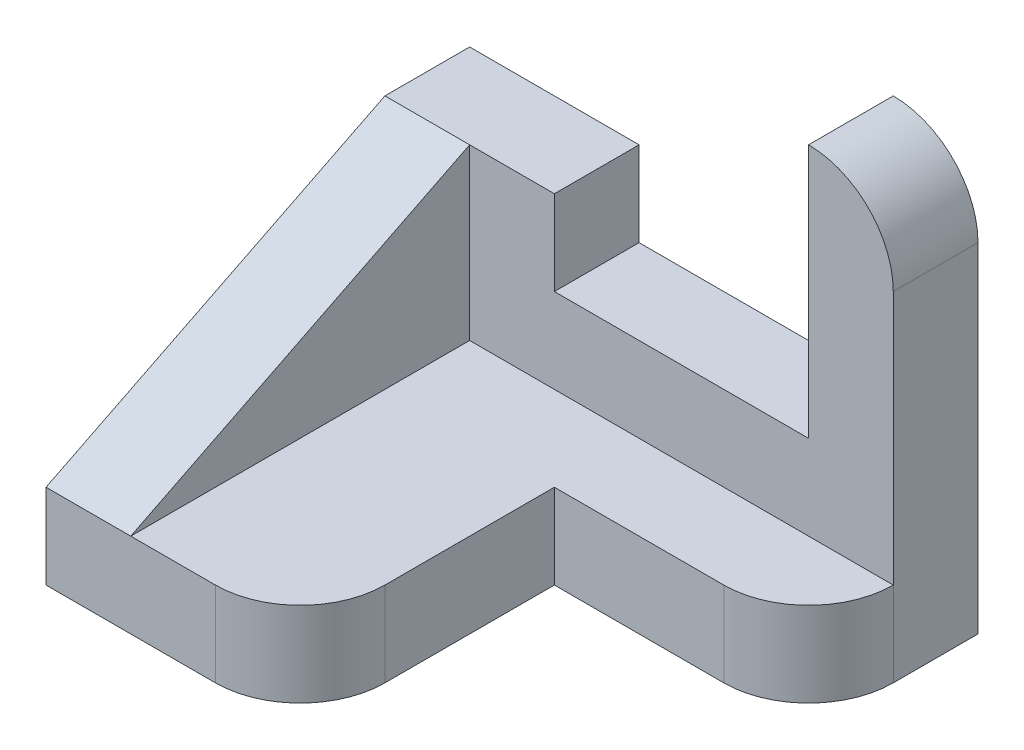
ISO-10303-21;
HEADER;
FILE_DESCRIPTION(('STEP AP214'),'2;1');
FILE_NAME('part.step','',(''),(''),'','','');
FILE_SCHEMA(('AUTOMOTIVE_DESIGN { 1 0 10303 214 1 1 1 1 }'));
ENDSEC;
DATA;
#1=APPLICATION_CONTEXT('core data for automotive mechanical design processes');
#2=APPLICATION_PROTOCOL_DEFINITION('international standard','automotive_design',2000,#1);
#3=PRODUCT_CONTEXT('',#1,'mechanical');
#4=PRODUCT('Part','Part','',(#3));
#5=PRODUCT_RELATED_PRODUCT_CATEGORY('part','',(#4));
#6=PRODUCT_DEFINITION_FORMATION('','',#4);
#7=PRODUCT_DEFINITION_CONTEXT('part definition',#1,'design');
#8=PRODUCT_DEFINITION('design','',#6,#7);
#9=PRODUCT_DEFINITION_SHAPE('','',#8);
#10=(LENGTH_UNIT() NAMED_UNIT(*) SI_UNIT(.MILLI.,.METRE.));
#11=(NAMED_UNIT(*) PLANE_ANGLE_UNIT() SI_UNIT($,.RADIAN.));
#12=(NAMED_UNIT(*) SI_UNIT($,.STERADIAN.) SOLID_ANGLE_UNIT());
#13=UNCERTAINTY_MEASURE_WITH_UNIT(LENGTH_MEASURE(1.E-05),#10,'distance_accuracy_value','');
#14=(GEOMETRIC_REPRESENTATION_CONTEXT(3) GLOBAL_UNCERTAINTY_ASSIGNED_CONTEXT((#13)) GLOBAL_UNIT_ASSIGNED_CONTEXT((#10,
#11,#12)) REPRESENTATION_CONTEXT('',''));
#15=CARTESIAN_POINT('',(0.,0.,0.));
#16=DIRECTION('',(0.,0.,1.));
#17=DIRECTION('',(1.,0.,0.));
#18=AXIS2_PLACEMENT_3D('',#15,#16,#17);
#19=CARTESIAN_POINT('',(0.,10.,0.));
#20=DIRECTION('',(0.,-1.,0.));
#21=DIRECTION('',(0.,0.,-1.));
#22=AXIS2_PLACEMENT_3D('',#19,#20,#21);
#23=PLANE('',#22);
#24=DIRECTION('',(1.,0.,0.));
#25=VECTOR('',#24,1.);
#26=CARTESIAN_POINT('',(30.,10.,-30.));
#27=LINE('',#26,#25);
#28=CARTESIAN_POINT('',(0.,10.,-30.));
#29=VERTEX_POINT('',#28);
#30=CARTESIAN_POINT('',(20.,10.,-30.));
#31=VERTEX_POINT('',#30);
#32=EDGE_CURVE('E231',#29,#31,#27,.T.);
#33=ORIENTED_EDGE('',*,*,#32,.T.);
#34=CARTESIAN_POINT('',(20.,10.,-40.));
#35=DIRECTION('',(0.,-1.,0.));
#36=DIRECTION('',(0.,0.,-1.));
#37=AXIS2_PLACEMENT_3D('',#34,#35,#36);
#38=CIRCLE('',#37,10.);
#39=CARTESIAN_POINT('',(30.,10.,-40.));
#40=VERTEX_POINT('',#39);
#41=EDGE_CURVE('E168',#31,#40,#38,.F.);
#42=ORIENTED_EDGE('',*,*,#41,.T.);
#43=DIRECTION('',(-1.,0.,0.));
#44=VECTOR('',#43,1.);
#45=CARTESIAN_POINT('',(-30.,10.,-40.));
#46=LINE('',#45,#44);
#47=CARTESIAN_POINT('',(-20.,10.,-40.));
#48=VERTEX_POINT('',#47);
#49=EDGE_CURVE('E158',#40,#48,#46,.T.);
#50=ORIENTED_EDGE('',*,*,#49,.T.);
#51=DIRECTION('',(0.,0.,1.));
#52=VECTOR('',#51,1.);
#53=CARTESIAN_POINT('',(-20.,10.,0.));
#54=LINE('',#53,#52);
#55=CARTESIAN_POINT('',(-20.,10.,0.));
#56=VERTEX_POINT('',#55);
#57=EDGE_CURVE('E144',#48,#56,#54,.T.);
#58=ORIENTED_EDGE('',*,*,#57,.T.);
#59=DIRECTION('',(1.,0.,0.));
#60=VECTOR('',#59,1.);
#61=CARTESIAN_POINT('',(0.,10.,0.));
#62=LINE('',#61,#60);
#63=CARTESIAN_POINT('',(-10.,10.,0.));
#64=VERTEX_POINT('',#63);
#65=EDGE_CURVE('E235',#56,#64,#62,.T.);
#66=ORIENTED_EDGE('',*,*,#65,.T.);
#67=CARTESIAN_POINT('',(-10.,10.,-10.));
#68=DIRECTION('',(0.,-1.,0.));
#69=DIRECTION('',(0.,0.,-1.));
#70=AXIS2_PLACEMENT_3D('',#67,#68,#69);
#71=CIRCLE('',#70,10.);
#72=CARTESIAN_POINT('',(0.,10.,-10.));
#73=VERTEX_POINT('',#72);
#74=EDGE_CURVE('E55',#64,#73,#71,.F.);
#75=ORIENTED_EDGE('',*,*,#74,.T.);
#76=DIRECTION('',(0.,0.,-1.));
#77=VECTOR('',#76,1.);
#78=CARTESIAN_POINT('',(0.,10.,-30.));
#79=LINE('',#78,#77);
#80=EDGE_CURVE('E228',#73,#29,#79,.T.);
#81=ORIENTED_EDGE('',*,*,#80,.T.);
#82=EDGE_LOOP('',(#33,#42,#50,#58,#66,#75,#81));
#83=FACE_BOUND('',#82,.T.);
#84=ADVANCED_FACE('F39',(#83),#23,.F.);
#85=CARTESIAN_POINT('',(0.,0.,-40.));
#86=DIRECTION('',(0.,0.,-1.));
#87=DIRECTION('',(0.,1.,0.));
#88=AXIS2_PLACEMENT_3D('',#85,#86,#87);
#89=PLANE('',#88);
#90=DIRECTION('',(0.,-1.,0.));
#91=VECTOR('',#90,1.);
#92=CARTESIAN_POINT('',(30.,50.,-40.));
#93=LINE('',#92,#91);
#94=CARTESIAN_POINT('',(30.,40.,-40.));
#95=VERTEX_POINT('',#94);
#96=EDGE_CURVE('E196',#95,#40,#93,.T.);
#97=ORIENTED_EDGE('',*,*,#96,.F.);
#98=CARTESIAN_POINT('',(20.,40.,-40.));
#99=DIRECTION('',(0.,0.,-1.));
#100=DIRECTION('',(0.,1.,0.));
#101=AXIS2_PLACEMENT_3D('',#98,#99,#100);
#102=CIRCLE('',#101,10.);
#103=CARTESIAN_POINT('',(20.,50.,-40.));
#104=VERTEX_POINT('',#103);
#105=EDGE_CURVE('E282',#95,#104,#102,.F.);
#106=ORIENTED_EDGE('',*,*,#105,.T.);
#107=DIRECTION('',(0.,1.,0.));
#108=VECTOR('',#107,1.);
#109=CARTESIAN_POINT('',(20.,20.,-40.));
#110=LINE('',#109,#108);
#111=CARTESIAN_POINT('',(20.,20.,-40.));
#112=VERTEX_POINT('',#111);
#113=EDGE_CURVE('E192',#112,#104,#110,.T.);
#114=ORIENTED_EDGE('',*,*,#113,.F.);
#115=DIRECTION('',(1.,0.,0.));
#116=VECTOR('',#115,1.);
#117=CARTESIAN_POINT('',(-9.99999999999999,20.,-40.));
#118=LINE('',#117,#116);
#119=CARTESIAN_POINT('',(-9.99999999999999,20.,-40.));
#120=VERTEX_POINT('',#119);
#121=EDGE_CURVE('E188',#120,#112,#118,.T.);
#122=ORIENTED_EDGE('',*,*,#121,.F.);
#123=DIRECTION('',(0.,-1.,0.));
#124=VECTOR('',#123,1.);
#125=CARTESIAN_POINT('',(-9.99999999999999,30.,-40.));
#126=LINE('',#125,#124);
#127=CARTESIAN_POINT('',(-9.99999999999999,30.,-40.));
#128=VERTEX_POINT('',#127);
#129=EDGE_CURVE('E184',#128,#120,#126,.T.);
#130=ORIENTED_EDGE('',*,*,#129,.F.);
#131=DIRECTION('',(1.,0.,0.));
#132=VECTOR('',#131,1.);
#133=CARTESIAN_POINT('',(-30.,30.,-40.));
#134=LINE('',#133,#132);
#135=CARTESIAN_POINT('',(-20.,30.,-40.));
#136=VERTEX_POINT('',#135);
#137=EDGE_CURVE('E161',#136,#128,#134,.T.);
#138=ORIENTED_EDGE('',*,*,#137,.F.);
#139=DIRECTION('',(0.,-1.,0.));
#140=VECTOR('',#139,1.);
#141=CARTESIAN_POINT('',(-20.,10.,-40.));
#142=LINE('',#141,#140);
#143=EDGE_CURVE('E147',#136,#48,#142,.T.);
#144=ORIENTED_EDGE('',*,*,#143,.T.);
#145=ORIENTED_EDGE('',*,*,#49,.F.);
#146=EDGE_LOOP('',(#97,#106,#114,#122,#130,#138,#144,#145));
#147=FACE_BOUND('',#146,.T.);
#148=ADVANCED_FACE('F157',(#147),#89,.F.);
#149=CARTESIAN_POINT('',(0.,10.,-30.));
#150=DIRECTION('',(-1.,0.,0.));
#151=DIRECTION('',(0.,0.,1.));
#152=AXIS2_PLACEMENT_3D('',#149,#150,#151);
#153=PLANE('',#152);
#154=ORIENTED_EDGE('',*,*,#80,.F.);
#155=DIRECTION('',(0.,-1.,0.));
#156=VECTOR('',#155,1.);
#157=CARTESIAN_POINT('',(0.,10.,-10.));
#158=LINE('',#157,#156);
#159=CARTESIAN_POINT('',(0.,0.,-10.));
#160=VERTEX_POINT('',#159);
#161=EDGE_CURVE('E48',#73,#160,#158,.T.);
#162=ORIENTED_EDGE('',*,*,#161,.T.);
#163=DIRECTION('',(0.,0.,-1.));
#164=VECTOR('',#163,1.);
#165=CARTESIAN_POINT('',(0.,0.,-30.));
#166=LINE('',#165,#164);
#167=CARTESIAN_POINT('',(0.,0.,-30.));
#168=VERTEX_POINT('',#167);
#169=EDGE_CURVE('E215',#160,#168,#166,.T.);
#170=ORIENTED_EDGE('',*,*,#169,.T.);
#171=DIRECTION('',(0.,-1.,0.));
#172=VECTOR('',#171,1.);
#173=CARTESIAN_POINT('',(0.,10.,-30.));
#174=LINE('',#173,#172);
#175=EDGE_CURVE('E268',#29,#168,#174,.T.);
#176=ORIENTED_EDGE('',*,*,#175,.F.);
#177=EDGE_LOOP('',(#154,#162,#170,#176));
#178=FACE_BOUND('',#177,.T.);
#179=ADVANCED_FACE('F302',(#178),#153,.F.);
#180=CARTESIAN_POINT('',(30.,10.,-30.));
#181=DIRECTION('',(0.,0.,-1.));
#182=DIRECTION('',(-1.,0.,0.));
#183=AXIS2_PLACEMENT_3D('',#180,#181,#182);
#184=PLANE('',#183);
#185=DIRECTION('',(1.,0.,0.));
#186=VECTOR('',#185,1.);
#187=CARTESIAN_POINT('',(30.,0.,-30.));
#188=LINE('',#187,#186);
#189=CARTESIAN_POINT('',(20.,0.,-30.));
#190=VERTEX_POINT('',#189);
#191=EDGE_CURVE('E242',#168,#190,#188,.T.);
#192=ORIENTED_EDGE('',*,*,#191,.T.);
#193=DIRECTION('',(0.,-1.,0.));
#194=VECTOR('',#193,1.);
#195=CARTESIAN_POINT('',(20.,10.,-30.));
#196=LINE('',#195,#194);
#197=EDGE_CURVE('E291',#190,#31,#196,.F.);
#198=ORIENTED_EDGE('',*,*,#197,.T.);
#199=ORIENTED_EDGE('',*,*,#32,.F.);
#200=ORIENTED_EDGE('',*,*,#175,.T.);
#201=EDGE_LOOP('',(#192,#198,#199,#200));
#202=FACE_BOUND('',#201,.T.);
#203=ADVANCED_FACE('F313',(#202),#184,.F.);
#204=CARTESIAN_POINT('',(30.,10.,-50.));
#205=DIRECTION('',(-1.,0.,0.));
#206=DIRECTION('',(0.,0.,1.));
#207=AXIS2_PLACEMENT_3D('',#204,#205,#206);
#208=PLANE('',#207);
#209=DIRECTION('',(0.,-1.,0.));
#210=VECTOR('',#209,1.);
#211=CARTESIAN_POINT('',(30.,10.,-50.));
#212=LINE('',#211,#210);
#213=CARTESIAN_POINT('',(30.,40.,-50.));
#214=VERTEX_POINT('',#213);
#215=CARTESIAN_POINT('',(30.,0.,-50.));
#216=VERTEX_POINT('',#215);
#217=EDGE_CURVE('E264',#214,#216,#212,.T.);
#218=ORIENTED_EDGE('',*,*,#217,.F.);
#219=DIRECTION('',(0.,0.,-1.));
#220=VECTOR('',#219,1.);
#221=CARTESIAN_POINT('',(30.,40.,-40.));
#222=LINE('',#221,#220);
#223=EDGE_CURVE('E279',#214,#95,#222,.F.);
#224=ORIENTED_EDGE('',*,*,#223,.T.);
#225=ORIENTED_EDGE('',*,*,#96,.T.);
#226=DIRECTION('',(0.,-1.,0.));
#227=VECTOR('',#226,1.);
#228=CARTESIAN_POINT('',(30.,10.,-40.));
#229=LINE('',#228,#227);
#230=CARTESIAN_POINT('',(30.,0.,-40.));
#231=VERTEX_POINT('',#230);
#232=EDGE_CURVE('E275',#40,#231,#229,.T.);
#233=ORIENTED_EDGE('',*,*,#232,.T.);
#234=DIRECTION('',(0.,0.,-1.));
#235=VECTOR('',#234,1.);
#236=CARTESIAN_POINT('',(30.,0.,-50.));
#237=LINE('',#236,#235);
#238=EDGE_CURVE('E246',#231,#216,#237,.T.);
#239=ORIENTED_EDGE('',*,*,#238,.T.);
#240=EDGE_LOOP('',(#218,#224,#225,#233,#239));
#241=FACE_BOUND('',#240,.T.);
#242=ADVANCED_FACE('F318',(#241),#208,.F.);
#243=CARTESIAN_POINT('',(-30.,10.,-50.));
#244=DIRECTION('',(0.,0.,1.));
#245=DIRECTION('',(1.,0.,0.));
#246=AXIS2_PLACEMENT_3D('',#243,#244,#245);
#247=PLANE('',#246);
#248=DIRECTION('',(0.,1.,0.));
#249=VECTOR('',#248,1.);
#250=CARTESIAN_POINT('',(20.,20.,-50.));
#251=LINE('',#250,#249);
#252=CARTESIAN_POINT('',(20.,20.,-50.));
#253=VERTEX_POINT('',#252);
#254=CARTESIAN_POINT('',(20.,50.,-50.));
#255=VERTEX_POINT('',#254);
#256=EDGE_CURVE('E171',#253,#255,#251,.T.);
#257=ORIENTED_EDGE('',*,*,#256,.T.);
#258=CARTESIAN_POINT('',(20.,40.,-50.));
#259=DIRECTION('',(0.,0.,1.));
#260=DIRECTION('',(1.,0.,0.));
#261=AXIS2_PLACEMENT_3D('',#258,#259,#260);
#262=CIRCLE('',#261,10.);
#263=EDGE_CURVE('E272',#255,#214,#262,.F.);
#264=ORIENTED_EDGE('',*,*,#263,.T.);
#265=ORIENTED_EDGE('',*,*,#217,.T.);
#266=DIRECTION('',(-1.,0.,0.));
#267=VECTOR('',#266,1.);
#268=CARTESIAN_POINT('',(-30.,0.,-50.));
#269=LINE('',#268,#267);
#270=CARTESIAN_POINT('',(-30.,0.,-50.));
#271=VERTEX_POINT('',#270);
#272=EDGE_CURVE('E249',#216,#271,#269,.T.);
#273=ORIENTED_EDGE('',*,*,#272,.T.);
#274=DIRECTION('',(0.,-1.,0.));
#275=VECTOR('',#274,1.);
#276=CARTESIAN_POINT('',(-30.,10.,-50.));
#277=LINE('',#276,#275);
#278=CARTESIAN_POINT('',(-30.,30.,-50.));
#279=VERTEX_POINT('',#278);
#280=EDGE_CURVE('E260',#279,#271,#277,.T.);
#281=ORIENTED_EDGE('',*,*,#280,.F.);
#282=DIRECTION('',(1.,0.,0.));
#283=VECTOR('',#282,1.);
#284=CARTESIAN_POINT('',(-30.,30.,-50.));
#285=LINE('',#284,#283);
#286=CARTESIAN_POINT('',(-9.99999999999999,30.,-50.));
#287=VERTEX_POINT('',#286);
#288=EDGE_CURVE('E200',#279,#287,#285,.T.);
#289=ORIENTED_EDGE('',*,*,#288,.T.);
#290=DIRECTION('',(0.,-1.,0.));
#291=VECTOR('',#290,1.);
#292=CARTESIAN_POINT('',(-9.99999999999999,30.,-50.));
#293=LINE('',#292,#291);
#294=CARTESIAN_POINT('',(-9.99999999999999,20.,-50.));
#295=VERTEX_POINT('',#294);
#296=EDGE_CURVE('E204',#287,#295,#293,.T.);
#297=ORIENTED_EDGE('',*,*,#296,.T.);
#298=DIRECTION('',(1.,0.,0.));
#299=VECTOR('',#298,1.);
#300=CARTESIAN_POINT('',(-9.99999999999999,20.,-50.));
#301=LINE('',#300,#299);
#302=EDGE_CURVE('E178',#295,#253,#301,.T.);
#303=ORIENTED_EDGE('',*,*,#302,.T.);
#304=EDGE_LOOP('',(#257,#264,#265,#273,#281,#289,#297,#303));
#305=FACE_BOUND('',#304,.T.);
#306=ADVANCED_FACE('F322',(#305),#247,.F.);
#307=CARTESIAN_POINT('',(-30.,10.,0.));
#308=DIRECTION('',(1.,0.,0.));
#309=DIRECTION('',(0.,0.,-1.));
#310=AXIS2_PLACEMENT_3D('',#307,#308,#309);
#311=PLANE('',#310);
#312=DIRECTION('',(0.,-1.,0.));
#313=VECTOR('',#312,1.);
#314=CARTESIAN_POINT('',(-30.,10.,0.));
#315=LINE('',#314,#313);
#316=CARTESIAN_POINT('',(-30.,10.,0.));
#317=VERTEX_POINT('',#316);
#318=CARTESIAN_POINT('',(-30.,0.,0.));
#319=VERTEX_POINT('',#318);
#320=EDGE_CURVE('E239',#317,#319,#315,.T.);
#321=ORIENTED_EDGE('',*,*,#320,.F.);
#322=DIRECTION('',(0.,0.447213595499958,-0.894427190999916));
#323=VECTOR('',#322,1.);
#324=CARTESIAN_POINT('',(-30.,30.,-40.));
#325=LINE('',#324,#323);
#326=CARTESIAN_POINT('',(-30.,30.,-40.));
#327=VERTEX_POINT('',#326);
#328=EDGE_CURVE('E164',#317,#327,#325,.T.);
#329=ORIENTED_EDGE('',*,*,#328,.T.);
#330=DIRECTION('',(0.,0.,-1.));
#331=VECTOR('',#330,1.);
#332=CARTESIAN_POINT('',(-30.,30.,-40.));
#333=LINE('',#332,#331);
#334=EDGE_CURVE('E199',#327,#279,#333,.T.);
#335=ORIENTED_EDGE('',*,*,#334,.T.);
#336=ORIENTED_EDGE('',*,*,#280,.T.);
#337=DIRECTION('',(0.,0.,1.));
#338=VECTOR('',#337,1.);
#339=CARTESIAN_POINT('',(-30.,0.,0.));
#340=LINE('',#339,#338);
#341=EDGE_CURVE('E252',#271,#319,#340,.T.);
#342=ORIENTED_EDGE('',*,*,#341,.T.);
#343=EDGE_LOOP('',(#321,#329,#335,#336,#342));
#344=FACE_BOUND('',#343,.T.);
#345=ADVANCED_FACE('F325',(#344),#311,.F.);
#346=CARTESIAN_POINT('',(0.,10.,0.));
#347=DIRECTION('',(0.,0.,-1.));
#348=DIRECTION('',(-1.,0.,0.));
#349=AXIS2_PLACEMENT_3D('',#346,#347,#348);
#350=PLANE('',#349);
#351=DIRECTION('',(1.,0.,0.));
#352=VECTOR('',#351,1.);
#353=CARTESIAN_POINT('',(0.,0.,0.));
#354=LINE('',#353,#352);
#355=CARTESIAN_POINT('',(-10.,0.,0.));
#356=VERTEX_POINT('',#355);
#357=EDGE_CURVE('E232',#319,#356,#354,.T.);
#358=ORIENTED_EDGE('',*,*,#357,.T.);
#359=DIRECTION('',(0.,-1.,0.));
#360=VECTOR('',#359,1.);
#361=CARTESIAN_POINT('',(-10.,10.,0.));
#362=LINE('',#361,#360);
#363=EDGE_CURVE('E11',#356,#64,#362,.F.);
#364=ORIENTED_EDGE('',*,*,#363,.T.);
#365=ORIENTED_EDGE('',*,*,#65,.F.);
#366=EDGE_CURVE('E236',#317,#56,#62,.T.);
#367=ORIENTED_EDGE('',*,*,#366,.F.);
#368=ORIENTED_EDGE('',*,*,#320,.T.);
#369=EDGE_LOOP('',(#358,#364,#365,#367,#368));
#370=FACE_BOUND('',#369,.T.);
#371=ADVANCED_FACE('F368',(#370),#350,.F.);
#372=CARTESIAN_POINT('',(0.,0.,0.));
#373=DIRECTION('',(0.,-1.,0.));
#374=DIRECTION('',(0.,0.,-1.));
#375=AXIS2_PLACEMENT_3D('',#372,#373,#374);
#376=PLANE('',#375);
#377=ORIENTED_EDGE('',*,*,#238,.F.);
#378=CARTESIAN_POINT('',(20.,0.,-40.));
#379=DIRECTION('',(0.,-1.,0.));
#380=DIRECTION('',(0.,0.,-1.));
#381=AXIS2_PLACEMENT_3D('',#378,#379,#380);
#382=CIRCLE('',#381,10.);
#383=EDGE_CURVE('E288',#231,#190,#382,.T.);
#384=ORIENTED_EDGE('',*,*,#383,.T.);
#385=ORIENTED_EDGE('',*,*,#191,.F.);
#386=ORIENTED_EDGE('',*,*,#169,.F.);
#387=CARTESIAN_POINT('',(-10.,0.,-10.));
#388=DIRECTION('',(0.,-1.,0.));
#389=DIRECTION('',(0.,0.,-1.));
#390=AXIS2_PLACEMENT_3D('',#387,#388,#389);
#391=CIRCLE('',#390,10.);
#392=EDGE_CURVE('E285',#160,#356,#391,.T.);
#393=ORIENTED_EDGE('',*,*,#392,.T.);
#394=ORIENTED_EDGE('',*,*,#357,.F.);
#395=ORIENTED_EDGE('',*,*,#341,.F.);
#396=ORIENTED_EDGE('',*,*,#272,.F.);
#397=EDGE_LOOP('',(#377,#384,#385,#386,#393,#394,#395,#396));
#398=FACE_BOUND('',#397,.T.);
#399=ADVANCED_FACE('F308',(#398),#376,.T.);
#400=CARTESIAN_POINT('',(20.,20.,-40.));
#401=DIRECTION('',(-1.,0.,0.));
#402=DIRECTION('',(0.,0.,1.));
#403=AXIS2_PLACEMENT_3D('',#400,#401,#402);
#404=PLANE('',#403);
#405=ORIENTED_EDGE('',*,*,#256,.F.);
#406=DIRECTION('',(0.,0.,-1.));
#407=VECTOR('',#406,1.);
#408=CARTESIAN_POINT('',(20.,20.,-40.));
#409=LINE('',#408,#407);
#410=EDGE_CURVE('E216',#112,#253,#409,.T.);
#411=ORIENTED_EDGE('',*,*,#410,.F.);
#412=ORIENTED_EDGE('',*,*,#113,.T.);
#413=DIRECTION('',(0.,0.,-1.));
#414=VECTOR('',#413,1.);
#415=CARTESIAN_POINT('',(20.,50.,-40.));
#416=LINE('',#415,#414);
#417=EDGE_CURVE('E211',#104,#255,#416,.T.);
#418=ORIENTED_EDGE('',*,*,#417,.T.);
#419=EDGE_LOOP('',(#405,#411,#412,#418));
#420=FACE_BOUND('',#419,.T.);
#421=ADVANCED_FACE('F342',(#420),#404,.T.);
#422=CARTESIAN_POINT('',(-9.99999999999999,20.,-40.));
#423=DIRECTION('',(0.,1.,0.));
#424=DIRECTION('',(0.,0.,1.));
#425=AXIS2_PLACEMENT_3D('',#422,#423,#424);
#426=PLANE('',#425);
#427=ORIENTED_EDGE('',*,*,#302,.F.);
#428=DIRECTION('',(0.,0.,-1.));
#429=VECTOR('',#428,1.);
#430=CARTESIAN_POINT('',(-9.99999999999999,20.,-40.));
#431=LINE('',#430,#429);
#432=EDGE_CURVE('E219',#120,#295,#431,.T.);
#433=ORIENTED_EDGE('',*,*,#432,.F.);
#434=ORIENTED_EDGE('',*,*,#121,.T.);
#435=ORIENTED_EDGE('',*,*,#410,.T.);
#436=EDGE_LOOP('',(#427,#433,#434,#435));
#437=FACE_BOUND('',#436,.T.);
#438=ADVANCED_FACE('F338',(#437),#426,.T.);
#439=CARTESIAN_POINT('',(-9.99999999999999,30.,-40.));
#440=DIRECTION('',(1.,0.,0.));
#441=DIRECTION('',(0.,0.,-1.));
#442=AXIS2_PLACEMENT_3D('',#439,#440,#441);
#443=PLANE('',#442);
#444=ORIENTED_EDGE('',*,*,#296,.F.);
#445=DIRECTION('',(0.,0.,-1.));
#446=VECTOR('',#445,1.);
#447=CARTESIAN_POINT('',(-9.99999999999999,30.,-40.));
#448=LINE('',#447,#446);
#449=EDGE_CURVE('E222',#128,#287,#448,.T.);
#450=ORIENTED_EDGE('',*,*,#449,.F.);
#451=ORIENTED_EDGE('',*,*,#129,.T.);
#452=ORIENTED_EDGE('',*,*,#432,.T.);
#453=EDGE_LOOP('',(#444,#450,#451,#452));
#454=FACE_BOUND('',#453,.T.);
#455=ADVANCED_FACE('F335',(#454),#443,.T.);
#456=CARTESIAN_POINT('',(-30.,30.,-40.));
#457=DIRECTION('',(0.,1.,0.));
#458=DIRECTION('',(-1.,0.,0.));
#459=AXIS2_PLACEMENT_3D('',#456,#457,#458);
#460=PLANE('',#459);
#461=ORIENTED_EDGE('',*,*,#288,.F.);
#462=ORIENTED_EDGE('',*,*,#334,.F.);
#463=EDGE_CURVE('E175',#327,#136,#134,.T.);
#464=ORIENTED_EDGE('',*,*,#463,.T.);
#465=ORIENTED_EDGE('',*,*,#137,.T.);
#466=ORIENTED_EDGE('',*,*,#449,.T.);
#467=EDGE_LOOP('',(#461,#462,#464,#465,#466));
#468=FACE_BOUND('',#467,.T.);
#469=ADVANCED_FACE('F330',(#468),#460,.T.);
#470=CARTESIAN_POINT('',(-20.,30.,-40.));
#471=DIRECTION('',(0.,0.894427190999916,0.447213595499958));
#472=DIRECTION('',(0.,-0.447213595499958,0.894427190999916));
#473=AXIS2_PLACEMENT_3D('',#470,#471,#472);
#474=PLANE('',#473);
#475=ORIENTED_EDGE('',*,*,#328,.F.);
#476=ORIENTED_EDGE('',*,*,#366,.T.);
#477=DIRECTION('',(0.,0.447213595499958,-0.894427190999916));
#478=VECTOR('',#477,1.);
#479=CARTESIAN_POINT('',(-20.,30.,-40.));
#480=LINE('',#479,#478);
#481=EDGE_CURVE('E149',#56,#136,#480,.T.);
#482=ORIENTED_EDGE('',*,*,#481,.T.);
#483=ORIENTED_EDGE('',*,*,#463,.F.);
#484=EDGE_LOOP('',(#475,#476,#482,#483));
#485=FACE_BOUND('',#484,.T.);
#486=ADVANCED_FACE('F354',(#485),#474,.T.);
#487=CARTESIAN_POINT('',(-20.,0.,0.));
#488=DIRECTION('',(-1.,0.,0.));
#489=DIRECTION('',(0.,0.,1.));
#490=AXIS2_PLACEMENT_3D('',#487,#488,#489);
#491=PLANE('',#490);
#492=ORIENTED_EDGE('',*,*,#143,.F.);
#493=ORIENTED_EDGE('',*,*,#481,.F.);
#494=ORIENTED_EDGE('',*,*,#57,.F.);
#495=EDGE_LOOP('',(#492,#493,#494));
#496=FACE_BOUND('',#495,.T.);
#497=ADVANCED_FACE('F146',(#496),#491,.F.);
#498=CARTESIAN_POINT('',(20.,40.,-40.));
#499=DIRECTION('',(0.,0.,1.));
#500=DIRECTION('',(1.,0.,0.));
#501=AXIS2_PLACEMENT_3D('',#498,#499,#500);
#502=CYLINDRICAL_SURFACE('',#501,10.);
#503=ORIENTED_EDGE('',*,*,#105,.F.);
#504=ORIENTED_EDGE('',*,*,#223,.F.);
#505=ORIENTED_EDGE('',*,*,#263,.F.);
#506=ORIENTED_EDGE('',*,*,#417,.F.);
#507=EDGE_LOOP('',(#503,#504,#505,#506));
#508=FACE_BOUND('',#507,.T.);
#509=ADVANCED_FACE('F347',(#508),#502,.T.);
#510=CARTESIAN_POINT('',(20.,10.,-40.));
#511=DIRECTION('',(0.,-1.,0.));
#512=DIRECTION('',(0.,0.,-1.));
#513=AXIS2_PLACEMENT_3D('',#510,#511,#512);
#514=CYLINDRICAL_SURFACE('',#513,10.);
#515=ORIENTED_EDGE('',*,*,#41,.F.);
#516=ORIENTED_EDGE('',*,*,#197,.F.);
#517=ORIENTED_EDGE('',*,*,#383,.F.);
#518=ORIENTED_EDGE('',*,*,#232,.F.);
#519=EDGE_LOOP('',(#515,#516,#517,#518));
#520=FACE_BOUND('',#519,.T.);
#521=ADVANCED_FACE('F315',(#520),#514,.T.);
#522=CARTESIAN_POINT('',(-10.,10.,-10.));
#523=DIRECTION('',(0.,-1.,0.));
#524=DIRECTION('',(0.,0.,-1.));
#525=AXIS2_PLACEMENT_3D('',#522,#523,#524);
#526=CYLINDRICAL_SURFACE('',#525,10.);
#527=ORIENTED_EDGE('',*,*,#74,.F.);
#528=ORIENTED_EDGE('',*,*,#363,.F.);
#529=ORIENTED_EDGE('',*,*,#392,.F.);
#530=ORIENTED_EDGE('',*,*,#161,.F.);
#531=EDGE_LOOP('',(#527,#528,#529,#530));
#532=FACE_BOUND('',#531,.T.);
#533=ADVANCED_FACE('F41',(#532),#526,.T.);
#534=CLOSED_SHELL('',(#84,#148,#179,#203,#242,#306,#345,#371,#399,#421,#438,#455,#469,#486,#497,
#509,#521,#533));
#535=MANIFOLD_SOLID_BREP('B2',#534);
#536=ADVANCED_BREP_SHAPE_REPRESENTATION('',(#18,#535),#14);
#537=SHAPE_DEFINITION_REPRESENTATION(#9,#536);
ENDSEC;
END-ISO-10303-21;
